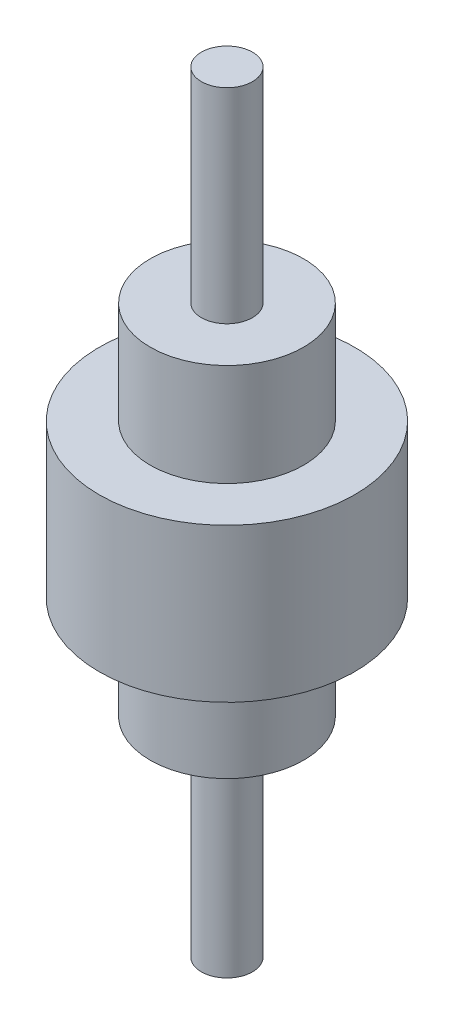
ISO-10303-21;
HEADER;
FILE_DESCRIPTION(('STEP AP214'),'2;1');
FILE_NAME('part.step','',(''),(''),'','','');
FILE_SCHEMA(('AUTOMOTIVE_DESIGN { 1 0 10303 214 1 1 1 1 }'));
ENDSEC;
DATA;
#1=APPLICATION_CONTEXT('core data for automotive mechanical design processes');
#2=APPLICATION_PROTOCOL_DEFINITION('international standard','automotive_design',2000,#1);
#3=PRODUCT_CONTEXT('',#1,'mechanical');
#4=PRODUCT('Part','Part','',(#3));
#5=PRODUCT_RELATED_PRODUCT_CATEGORY('part','',(#4));
#6=PRODUCT_DEFINITION_FORMATION('','',#4);
#7=PRODUCT_DEFINITION_CONTEXT('part definition',#1,'design');
#8=PRODUCT_DEFINITION('design','',#6,#7);
#9=PRODUCT_DEFINITION_SHAPE('','',#8);
#10=(LENGTH_UNIT() NAMED_UNIT(*) SI_UNIT(.MILLI.,.METRE.));
#11=(NAMED_UNIT(*) PLANE_ANGLE_UNIT() SI_UNIT($,.RADIAN.));
#12=(NAMED_UNIT(*) SI_UNIT($,.STERADIAN.) SOLID_ANGLE_UNIT());
#13=UNCERTAINTY_MEASURE_WITH_UNIT(LENGTH_MEASURE(1.E-05),#10,'distance_accuracy_value','');
#14=(GEOMETRIC_REPRESENTATION_CONTEXT(3) GLOBAL_UNCERTAINTY_ASSIGNED_CONTEXT((#13)) GLOBAL_UNIT_ASSIGNED_CONTEXT((#10,
#11,#12)) REPRESENTATION_CONTEXT('',''));
#15=CARTESIAN_POINT('',(0.,0.,0.));
#16=DIRECTION('',(0.,0.,1.));
#17=DIRECTION('',(1.,0.,0.));
#18=AXIS2_PLACEMENT_3D('',#15,#16,#17);
#19=CARTESIAN_POINT('',(0.,0.,0.));
#20=DIRECTION('',(0.,1.,0.));
#21=DIRECTION('',(0.,0.,1.));
#22=AXIS2_PLACEMENT_3D('',#19,#20,#21);
#23=PLANE('',#22);
#24=CARTESIAN_POINT('',(0.,0.,0.));
#25=DIRECTION('',(0.,1.,0.));
#26=DIRECTION('',(0.,0.,1.));
#27=AXIS2_PLACEMENT_3D('',#24,#25,#26);
#28=CIRCLE('',#27,10.);
#29=CARTESIAN_POINT('',(0.,0.,10.));
#30=VERTEX_POINT('',#29);
#31=EDGE_CURVE('E10',#30,#30,#28,.T.);
#32=ORIENTED_EDGE('',*,*,#31,.F.);
#33=EDGE_LOOP('',(#32));
#34=FACE_BOUND('',#33,.T.);
#35=ADVANCED_FACE('F30',(#34),#23,.F.);
#36=CARTESIAN_POINT('',(10.,301.693933425089,0.));
#37=DIRECTION('',(0.,-1.,0.));
#38=DIRECTION('',(0.,0.,-1.));
#39=AXIS2_PLACEMENT_3D('',#36,#37,#38);
#40=PLANE('',#39);
#41=CARTESIAN_POINT('',(0.,301.693933425089,0.));
#42=DIRECTION('',(0.,1.,0.));
#43=DIRECTION('',(0.,0.,1.));
#44=AXIS2_PLACEMENT_3D('',#41,#42,#43);
#45=CIRCLE('',#44,10.);
#46=CARTESIAN_POINT('',(0.,301.693933425089,10.));
#47=VERTEX_POINT('',#46);
#48=EDGE_CURVE('E36',#47,#47,#45,.T.);
#49=ORIENTED_EDGE('',*,*,#48,.T.);
#50=EDGE_LOOP('',(#49));
#51=FACE_BOUND('',#50,.T.);
#52=ADVANCED_FACE('F80',(#51),#40,.F.);
#53=CARTESIAN_POINT('',(0.,99.4903565002157,0.));
#54=DIRECTION('',(0.,1.,0.));
#55=DIRECTION('',(0.,0.,1.));
#56=AXIS2_PLACEMENT_3D('',#53,#54,#55);
#57=CYLINDRICAL_SURFACE('',#56,10.);
#58=ORIENTED_EDGE('',*,*,#48,.F.);
#59=EDGE_LOOP('',(#58));
#60=FACE_BOUND('',#59,.T.);
#61=CARTESIAN_POINT('',(0.,221.693933425089,0.));
#62=DIRECTION('',(0.,1.,0.));
#63=DIRECTION('',(0.,0.,1.));
#64=AXIS2_PLACEMENT_3D('',#61,#62,#63);
#65=CIRCLE('',#64,10.);
#66=CARTESIAN_POINT('',(0.,221.693933425089,10.));
#67=VERTEX_POINT('',#66);
#68=EDGE_CURVE('E40',#67,#67,#65,.T.);
#69=ORIENTED_EDGE('',*,*,#68,.T.);
#70=EDGE_LOOP('',(#69));
#71=FACE_BOUND('',#70,.T.);
#72=ADVANCED_FACE('F85',(#60,#71),#57,.T.);
#73=CARTESIAN_POINT('',(30.,221.693933425089,0.));
#74=DIRECTION('',(0.,-1.,0.));
#75=DIRECTION('',(0.,0.,-1.));
#76=AXIS2_PLACEMENT_3D('',#73,#74,#75);
#77=PLANE('',#76);
#78=ORIENTED_EDGE('',*,*,#68,.F.);
#79=EDGE_LOOP('',(#78));
#80=FACE_BOUND('',#79,.T.);
#81=CARTESIAN_POINT('',(0.,221.693933425089,0.));
#82=DIRECTION('',(0.,1.,0.));
#83=DIRECTION('',(0.,0.,1.));
#84=AXIS2_PLACEMENT_3D('',#81,#82,#83);
#85=CIRCLE('',#84,30.);
#86=CARTESIAN_POINT('',(0.,221.693933425089,30.));
#87=VERTEX_POINT('',#86);
#88=EDGE_CURVE('E44',#87,#87,#85,.T.);
#89=ORIENTED_EDGE('',*,*,#88,.T.);
#90=EDGE_LOOP('',(#89));
#91=FACE_BOUND('',#90,.T.);
#92=ADVANCED_FACE('F89',(#80,#91),#77,.F.);
#93=CARTESIAN_POINT('',(0.,99.4903565002157,0.));
#94=DIRECTION('',(0.,1.,0.));
#95=DIRECTION('',(0.,0.,1.));
#96=AXIS2_PLACEMENT_3D('',#93,#94,#95);
#97=CYLINDRICAL_SURFACE('',#96,30.);
#98=ORIENTED_EDGE('',*,*,#88,.F.);
#99=EDGE_LOOP('',(#98));
#100=FACE_BOUND('',#99,.T.);
#101=CARTESIAN_POINT('',(0.,181.693933425089,0.));
#102=DIRECTION('',(0.,1.,0.));
#103=DIRECTION('',(0.,0.,1.));
#104=AXIS2_PLACEMENT_3D('',#101,#102,#103);
#105=CIRCLE('',#104,30.);
#106=CARTESIAN_POINT('',(0.,181.693933425089,30.));
#107=VERTEX_POINT('',#106);
#108=EDGE_CURVE('E49',#107,#107,#105,.T.);
#109=ORIENTED_EDGE('',*,*,#108,.T.);
#110=EDGE_LOOP('',(#109));
#111=FACE_BOUND('',#110,.T.);
#112=ADVANCED_FACE('F95',(#100,#111),#97,.T.);
#113=CARTESIAN_POINT('',(50.,181.693933425089,0.));
#114=DIRECTION('',(0.,-1.,0.));
#115=DIRECTION('',(0.,0.,-1.));
#116=AXIS2_PLACEMENT_3D('',#113,#114,#115);
#117=PLANE('',#116);
#118=ORIENTED_EDGE('',*,*,#108,.F.);
#119=EDGE_LOOP('',(#118));
#120=FACE_BOUND('',#119,.T.);
#121=CARTESIAN_POINT('',(0.,181.693933425089,0.));
#122=DIRECTION('',(0.,1.,0.));
#123=DIRECTION('',(0.,0.,1.));
#124=AXIS2_PLACEMENT_3D('',#121,#122,#123);
#125=CIRCLE('',#124,50.);
#126=CARTESIAN_POINT('',(0.,181.693933425089,50.));
#127=VERTEX_POINT('',#126);
#128=EDGE_CURVE('E52',#127,#127,#125,.T.);
#129=ORIENTED_EDGE('',*,*,#128,.T.);
#130=EDGE_LOOP('',(#129));
#131=FACE_BOUND('',#130,.T.);
#132=ADVANCED_FACE('F99',(#120,#131),#117,.F.);
#133=CARTESIAN_POINT('',(0.,99.4903565002157,0.));
#134=DIRECTION('',(0.,1.,0.));
#135=DIRECTION('',(0.,0.,1.));
#136=AXIS2_PLACEMENT_3D('',#133,#134,#135);
#137=CYLINDRICAL_SURFACE('',#136,50.);
#138=ORIENTED_EDGE('',*,*,#128,.F.);
#139=EDGE_LOOP('',(#138));
#140=FACE_BOUND('',#139,.T.);
#141=CARTESIAN_POINT('',(0.,121.693933425089,0.));
#142=DIRECTION('',(0.,1.,0.));
#143=DIRECTION('',(0.,0.,1.));
#144=AXIS2_PLACEMENT_3D('',#141,#142,#143);
#145=CIRCLE('',#144,50.);
#146=CARTESIAN_POINT('',(0.,121.693933425089,50.));
#147=VERTEX_POINT('',#146);
#148=EDGE_CURVE('E55',#147,#147,#145,.T.);
#149=ORIENTED_EDGE('',*,*,#148,.T.);
#150=EDGE_LOOP('',(#149));
#151=FACE_BOUND('',#150,.T.);
#152=ADVANCED_FACE('F103',(#140,#151),#137,.T.);
#153=CARTESIAN_POINT('',(30.,121.693933425089,0.));
#154=DIRECTION('',(0.,1.,0.));
#155=DIRECTION('',(0.,0.,1.));
#156=AXIS2_PLACEMENT_3D('',#153,#154,#155);
#157=PLANE('',#156);
#158=ORIENTED_EDGE('',*,*,#148,.F.);
#159=EDGE_LOOP('',(#158));
#160=FACE_BOUND('',#159,.T.);
#161=CARTESIAN_POINT('',(0.,121.693933425089,0.));
#162=DIRECTION('',(0.,1.,0.));
#163=DIRECTION('',(0.,0.,1.));
#164=AXIS2_PLACEMENT_3D('',#161,#162,#163);
#165=CIRCLE('',#164,30.);
#166=CARTESIAN_POINT('',(0.,121.693933425089,30.));
#167=VERTEX_POINT('',#166);
#168=EDGE_CURVE('E58',#167,#167,#165,.T.);
#169=ORIENTED_EDGE('',*,*,#168,.T.);
#170=EDGE_LOOP('',(#169));
#171=FACE_BOUND('',#170,.T.);
#172=ADVANCED_FACE('F107',(#160,#171),#157,.F.);
#173=CARTESIAN_POINT('',(0.,99.4903565002157,0.));
#174=DIRECTION('',(0.,1.,0.));
#175=DIRECTION('',(0.,0.,1.));
#176=AXIS2_PLACEMENT_3D('',#173,#174,#175);
#177=CYLINDRICAL_SURFACE('',#176,30.);
#178=ORIENTED_EDGE('',*,*,#168,.F.);
#179=EDGE_LOOP('',(#178));
#180=FACE_BOUND('',#179,.T.);
#181=CARTESIAN_POINT('',(0.,81.6939334250888,0.));
#182=DIRECTION('',(0.,1.,0.));
#183=DIRECTION('',(0.,0.,1.));
#184=AXIS2_PLACEMENT_3D('',#181,#182,#183);
#185=CIRCLE('',#184,30.);
#186=CARTESIAN_POINT('',(0.,81.6939334250888,30.));
#187=VERTEX_POINT('',#186);
#188=EDGE_CURVE('E61',#187,#187,#185,.T.);
#189=ORIENTED_EDGE('',*,*,#188,.T.);
#190=EDGE_LOOP('',(#189));
#191=FACE_BOUND('',#190,.T.);
#192=ADVANCED_FACE('F76',(#180,#191),#177,.T.);
#193=CARTESIAN_POINT('',(10.,81.6939334250888,0.));
#194=DIRECTION('',(0.,1.,0.));
#195=DIRECTION('',(0.,0.,1.));
#196=AXIS2_PLACEMENT_3D('',#193,#194,#195);
#197=PLANE('',#196);
#198=ORIENTED_EDGE('',*,*,#188,.F.);
#199=EDGE_LOOP('',(#198));
#200=FACE_BOUND('',#199,.T.);
#201=CARTESIAN_POINT('',(0.,81.6939334250888,0.));
#202=DIRECTION('',(0.,1.,0.));
#203=DIRECTION('',(0.,0.,1.));
#204=AXIS2_PLACEMENT_3D('',#201,#202,#203);
#205=CIRCLE('',#204,10.);
#206=CARTESIAN_POINT('',(0.,81.6939334250888,10.));
#207=VERTEX_POINT('',#206);
#208=EDGE_CURVE('E64',#207,#207,#205,.T.);
#209=ORIENTED_EDGE('',*,*,#208,.T.);
#210=EDGE_LOOP('',(#209));
#211=FACE_BOUND('',#210,.T.);
#212=ADVANCED_FACE('F68',(#200,#211),#197,.F.);
#213=CARTESIAN_POINT('',(0.,99.4903565002157,0.));
#214=DIRECTION('',(0.,1.,0.));
#215=DIRECTION('',(0.,0.,1.));
#216=AXIS2_PLACEMENT_3D('',#213,#214,#215);
#217=CYLINDRICAL_SURFACE('',#216,10.);
#218=ORIENTED_EDGE('',*,*,#208,.F.);
#219=EDGE_LOOP('',(#218));
#220=FACE_BOUND('',#219,.T.);
#221=ORIENTED_EDGE('',*,*,#31,.T.);
#222=EDGE_LOOP('',(#221));
#223=FACE_BOUND('',#222,.T.);
#224=ADVANCED_FACE('F70',(#220,#223),#217,.T.);
#225=CLOSED_SHELL('',(#35,#52,#72,#92,#112,#132,#152,#172,#192,#212,#224));
#226=MANIFOLD_SOLID_BREP('B2',#225);
#227=ADVANCED_BREP_SHAPE_REPRESENTATION('',(#18,#226),#14);
#228=SHAPE_DEFINITION_REPRESENTATION(#9,#227);
ENDSEC;
END-ISO-10303-21;
